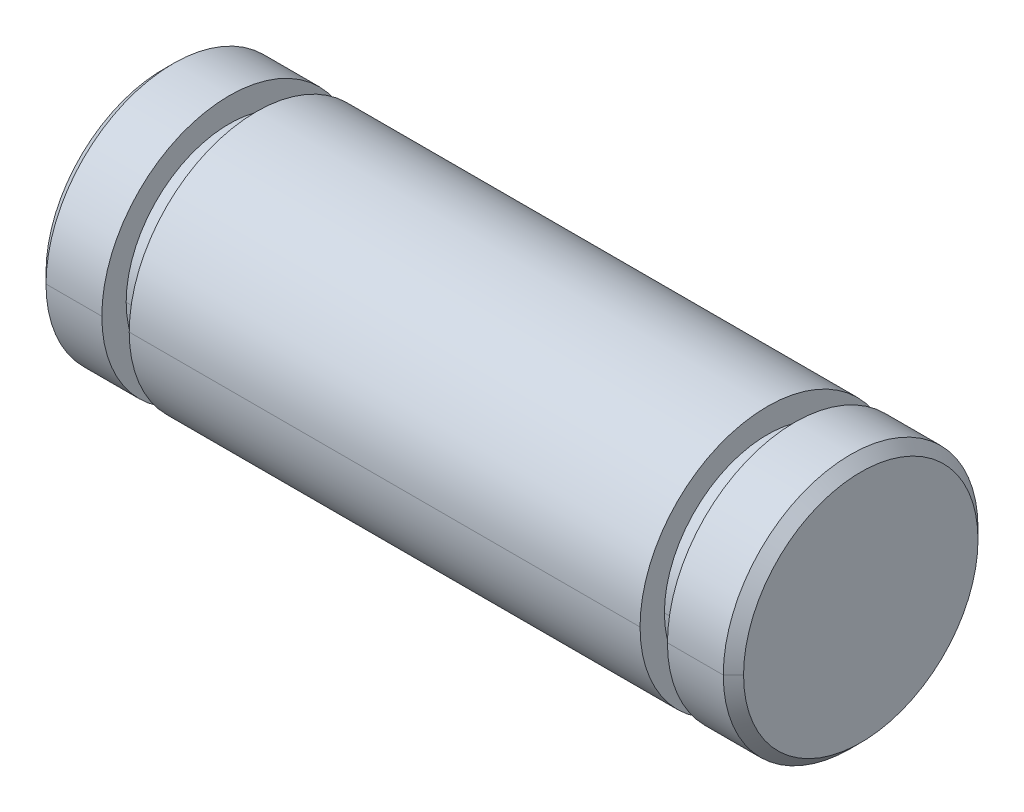
ISO-10303-21;
HEADER;
FILE_DESCRIPTION(('STEP AP214'),'2;1');
FILE_NAME('part.step','',(''),(''),'','','');
FILE_SCHEMA(('AUTOMOTIVE_DESIGN { 1 0 10303 214 1 1 1 1 }'));
ENDSEC;
DATA;
#1=APPLICATION_CONTEXT('core data for automotive mechanical design processes');
#2=APPLICATION_PROTOCOL_DEFINITION('international standard','automotive_design',2000,#1);
#3=PRODUCT_CONTEXT('',#1,'mechanical');
#4=PRODUCT('Part','Part','',(#3));
#5=PRODUCT_RELATED_PRODUCT_CATEGORY('part','',(#4));
#6=PRODUCT_DEFINITION_FORMATION('','',#4);
#7=PRODUCT_DEFINITION_CONTEXT('part definition',#1,'design');
#8=PRODUCT_DEFINITION('design','',#6,#7);
#9=PRODUCT_DEFINITION_SHAPE('','',#8);
#10=(LENGTH_UNIT() NAMED_UNIT(*) SI_UNIT(.MILLI.,.METRE.));
#11=(NAMED_UNIT(*) PLANE_ANGLE_UNIT() SI_UNIT($,.RADIAN.));
#12=(NAMED_UNIT(*) SI_UNIT($,.STERADIAN.) SOLID_ANGLE_UNIT());
#13=UNCERTAINTY_MEASURE_WITH_UNIT(LENGTH_MEASURE(1.E-05),#10,'distance_accuracy_value','');
#14=(GEOMETRIC_REPRESENTATION_CONTEXT(3) GLOBAL_UNCERTAINTY_ASSIGNED_CONTEXT((#13)) GLOBAL_UNIT_ASSIGNED_CONTEXT((#10,
#11,#12)) REPRESENTATION_CONTEXT('',''));
#15=CARTESIAN_POINT('',(0.,0.,0.));
#16=DIRECTION('',(0.,0.,1.));
#17=DIRECTION('',(1.,0.,0.));
#18=AXIS2_PLACEMENT_3D('',#15,#16,#17);
#19=CARTESIAN_POINT('',(12.7127,0.,0.));
#20=DIRECTION('',(-1.,0.,0.));
#21=DIRECTION('',(0.,-1.,0.));
#22=AXIS2_PLACEMENT_3D('',#19,#20,#21);
#23=CONICAL_SURFACE('',#22,4.78155,0.7853981634);
#24=CARTESIAN_POINT('',(13.0937,0.,0.));
#25=DIRECTION('',(1.,0.,0.));
#26=DIRECTION('',(0.,0.,-1.));
#27=AXIS2_PLACEMENT_3D('',#24,#25,#26);
#28=CIRCLE('',#27,4.40055);
#29=CARTESIAN_POINT('',(13.0937,0.,-4.40055));
#30=VERTEX_POINT('',#29);
#31=CARTESIAN_POINT('',(13.093699999999,0.,4.40054999999903));
#32=VERTEX_POINT('',#31);
#33=EDGE_CURVE('E10',#30,#32,#28,.T.);
#34=ORIENTED_EDGE('',*,*,#33,.F.);
#35=DIRECTION('',(-0.707106781184743,0.,-0.707106781188353));
#36=VECTOR('',#35,1.);
#37=CARTESIAN_POINT('',(13.093699999999,0.,-4.40054999999903));
#38=LINE('',#37,#36);
#39=CARTESIAN_POINT('',(12.7127,0.,-4.78155));
#40=VERTEX_POINT('',#39);
#41=EDGE_CURVE('E24',#30,#40,#38,.T.);
#42=ORIENTED_EDGE('',*,*,#41,.T.);
#43=CARTESIAN_POINT('',(12.7127,0.,0.));
#44=DIRECTION('',(1.,0.,0.));
#45=DIRECTION('',(0.,0.,-1.));
#46=AXIS2_PLACEMENT_3D('',#43,#44,#45);
#47=CIRCLE('',#46,4.78155);
#48=CARTESIAN_POINT('',(12.7127,0.,4.78155));
#49=VERTEX_POINT('',#48);
#50=EDGE_CURVE('E262',#40,#49,#47,.T.);
#51=ORIENTED_EDGE('',*,*,#50,.T.);
#52=DIRECTION('',(-0.707106781184743,0.,0.707106781188353));
#53=VECTOR('',#52,1.);
#54=CARTESIAN_POINT('',(13.093699999999,0.,4.40054999999903));
#55=LINE('',#54,#53);
#56=EDGE_CURVE('E257',#32,#49,#55,.T.);
#57=ORIENTED_EDGE('',*,*,#56,.F.);
#58=EDGE_LOOP('',(#34,#42,#51,#57));
#59=FACE_BOUND('',#58,.T.);
#60=ADVANCED_FACE('F16',(#59),#23,.T.);
#61=CARTESIAN_POINT('',(12.7127,0.,0.));
#62=DIRECTION('',(-1.,0.,0.));
#63=DIRECTION('',(0.,1.,0.));
#64=AXIS2_PLACEMENT_3D('',#61,#62,#63);
#65=CONICAL_SURFACE('',#64,4.78155,0.7853981634);
#66=CARTESIAN_POINT('',(12.7127,0.,0.));
#67=DIRECTION('',(1.,0.,0.));
#68=DIRECTION('',(0.,0.,-1.));
#69=AXIS2_PLACEMENT_3D('',#66,#67,#68);
#70=CIRCLE('',#69,4.78155);
#71=EDGE_CURVE('E253',#49,#40,#70,.T.);
#72=ORIENTED_EDGE('',*,*,#71,.T.);
#73=ORIENTED_EDGE('',*,*,#41,.F.);
#74=CARTESIAN_POINT('',(13.0937,0.,0.));
#75=DIRECTION('',(1.,0.,0.));
#76=DIRECTION('',(0.,0.,-1.));
#77=AXIS2_PLACEMENT_3D('',#74,#75,#76);
#78=CIRCLE('',#77,4.40055);
#79=EDGE_CURVE('E248',#32,#30,#78,.T.);
#80=ORIENTED_EDGE('',*,*,#79,.F.);
#81=ORIENTED_EDGE('',*,*,#56,.T.);
#82=EDGE_LOOP('',(#72,#73,#80,#81));
#83=FACE_BOUND('',#82,.T.);
#84=ADVANCED_FACE('F276',(#83),#65,.T.);
#85=CARTESIAN_POINT('',(13.0937,4.40055,0.));
#86=DIRECTION('',(-1.,0.,0.));
#87=DIRECTION('',(0.,0.,1.));
#88=AXIS2_PLACEMENT_3D('',#85,#86,#87);
#89=PLANE('',#88);
#90=ORIENTED_EDGE('',*,*,#33,.T.);
#91=ORIENTED_EDGE('',*,*,#79,.T.);
#92=EDGE_LOOP('',(#90,#91));
#93=FACE_BOUND('',#92,.T.);
#94=ADVANCED_FACE('F354',(#93),#89,.F.);
#95=CARTESIAN_POINT('',(13.0937,0.,0.));
#96=DIRECTION('',(-1.,0.,0.));
#97=DIRECTION('',(0.,1.,0.));
#98=AXIS2_PLACEMENT_3D('',#95,#96,#97);
#99=CYLINDRICAL_SURFACE('',#98,4.78155);
#100=CARTESIAN_POINT('',(10.6172,0.,0.));
#101=DIRECTION('',(1.,0.,0.));
#102=DIRECTION('',(0.,0.,-1.));
#103=AXIS2_PLACEMENT_3D('',#100,#101,#102);
#104=CIRCLE('',#103,4.78155);
#105=CARTESIAN_POINT('',(10.6172,0.,4.78155));
#106=VERTEX_POINT('',#105);
#107=CARTESIAN_POINT('',(10.6172,0.,-4.78155));
#108=VERTEX_POINT('',#107);
#109=EDGE_CURVE('E244',#106,#108,#104,.T.);
#110=ORIENTED_EDGE('',*,*,#109,.T.);
#111=DIRECTION('',(-1.,0.,0.));
#112=VECTOR('',#111,1.);
#113=CARTESIAN_POINT('',(12.7127,0.,-4.78155));
#114=LINE('',#113,#112);
#115=EDGE_CURVE('E239',#40,#108,#114,.T.);
#116=ORIENTED_EDGE('',*,*,#115,.F.);
#117=ORIENTED_EDGE('',*,*,#71,.F.);
#118=DIRECTION('',(-1.,0.,0.));
#119=VECTOR('',#118,1.);
#120=CARTESIAN_POINT('',(12.7127,0.,4.78155));
#121=LINE('',#120,#119);
#122=EDGE_CURVE('E235',#49,#106,#121,.T.);
#123=ORIENTED_EDGE('',*,*,#122,.T.);
#124=EDGE_LOOP('',(#110,#116,#117,#123));
#125=FACE_BOUND('',#124,.T.);
#126=ADVANCED_FACE('F279',(#125),#99,.T.);
#127=CARTESIAN_POINT('',(13.0937,0.,0.));
#128=DIRECTION('',(-1.,0.,0.));
#129=DIRECTION('',(0.,-1.,0.));
#130=AXIS2_PLACEMENT_3D('',#127,#128,#129);
#131=CYLINDRICAL_SURFACE('',#130,4.78155);
#132=ORIENTED_EDGE('',*,*,#50,.F.);
#133=ORIENTED_EDGE('',*,*,#115,.T.);
#134=CARTESIAN_POINT('',(10.6172,0.,0.));
#135=DIRECTION('',(1.,0.,0.));
#136=DIRECTION('',(0.,0.,-1.));
#137=AXIS2_PLACEMENT_3D('',#134,#135,#136);
#138=CIRCLE('',#137,4.78155);
#139=EDGE_CURVE('E230',#108,#106,#138,.T.);
#140=ORIENTED_EDGE('',*,*,#139,.T.);
#141=ORIENTED_EDGE('',*,*,#122,.F.);
#142=EDGE_LOOP('',(#132,#133,#140,#141));
#143=FACE_BOUND('',#142,.T.);
#144=ADVANCED_FACE('F280',(#143),#131,.T.);
#145=CARTESIAN_POINT('',(10.6172,3.86715,0.));
#146=DIRECTION('',(1.,0.,0.));
#147=DIRECTION('',(0.,0.,-1.));
#148=AXIS2_PLACEMENT_3D('',#145,#146,#147);
#149=PLANE('',#148);
#150=ORIENTED_EDGE('',*,*,#139,.F.);
#151=ORIENTED_EDGE('',*,*,#109,.F.);
#152=EDGE_LOOP('',(#150,#151));
#153=FACE_BOUND('',#152,.T.);
#154=CARTESIAN_POINT('',(10.6172,0.,0.));
#155=DIRECTION('',(1.,0.,0.));
#156=DIRECTION('',(0.,0.,-1.));
#157=AXIS2_PLACEMENT_3D('',#154,#155,#156);
#158=CIRCLE('',#157,3.86715);
#159=CARTESIAN_POINT('',(10.6172,0.,-3.86715));
#160=VERTEX_POINT('',#159);
#161=CARTESIAN_POINT('',(10.6172,0.,3.86715));
#162=VERTEX_POINT('',#161);
#163=EDGE_CURVE('E226',#160,#162,#158,.T.);
#164=ORIENTED_EDGE('',*,*,#163,.T.);
#165=CARTESIAN_POINT('',(10.6172,0.,0.));
#166=DIRECTION('',(1.,0.,0.));
#167=DIRECTION('',(0.,0.,-1.));
#168=AXIS2_PLACEMENT_3D('',#165,#166,#167);
#169=CIRCLE('',#168,3.86715);
#170=EDGE_CURVE('E222',#162,#160,#169,.T.);
#171=ORIENTED_EDGE('',*,*,#170,.T.);
#172=EDGE_LOOP('',(#164,#171));
#173=FACE_BOUND('',#172,.T.);
#174=ADVANCED_FACE('F284',(#153,#173),#149,.F.);
#175=CARTESIAN_POINT('',(13.0937,0.,0.));
#176=DIRECTION('',(-1.,0.,0.));
#177=DIRECTION('',(0.,1.,0.));
#178=AXIS2_PLACEMENT_3D('',#175,#176,#177);
#179=CYLINDRICAL_SURFACE('',#178,3.86715);
#180=CARTESIAN_POINT('',(9.5885,0.,0.));
#181=DIRECTION('',(1.,0.,0.));
#182=DIRECTION('',(0.,0.,-1.));
#183=AXIS2_PLACEMENT_3D('',#180,#181,#182);
#184=CIRCLE('',#183,3.86715);
#185=CARTESIAN_POINT('',(9.5885,0.,3.86715));
#186=VERTEX_POINT('',#185);
#187=CARTESIAN_POINT('',(9.5885,0.,-3.86715));
#188=VERTEX_POINT('',#187);
#189=EDGE_CURVE('E218',#186,#188,#184,.T.);
#190=ORIENTED_EDGE('',*,*,#189,.T.);
#191=DIRECTION('',(-1.,0.,0.));
#192=VECTOR('',#191,1.);
#193=CARTESIAN_POINT('',(10.6172,0.,-3.86715));
#194=LINE('',#193,#192);
#195=EDGE_CURVE('E213',#160,#188,#194,.T.);
#196=ORIENTED_EDGE('',*,*,#195,.F.);
#197=ORIENTED_EDGE('',*,*,#170,.F.);
#198=DIRECTION('',(-1.,0.,0.));
#199=VECTOR('',#198,1.);
#200=CARTESIAN_POINT('',(10.6172,0.,3.86715));
#201=LINE('',#200,#199);
#202=EDGE_CURVE('E209',#162,#186,#201,.T.);
#203=ORIENTED_EDGE('',*,*,#202,.T.);
#204=EDGE_LOOP('',(#190,#196,#197,#203));
#205=FACE_BOUND('',#204,.T.);
#206=ADVANCED_FACE('F287',(#205),#179,.T.);
#207=CARTESIAN_POINT('',(13.0937,0.,0.));
#208=DIRECTION('',(-1.,0.,0.));
#209=DIRECTION('',(0.,-1.,0.));
#210=AXIS2_PLACEMENT_3D('',#207,#208,#209);
#211=CYLINDRICAL_SURFACE('',#210,3.86715);
#212=ORIENTED_EDGE('',*,*,#163,.F.);
#213=ORIENTED_EDGE('',*,*,#195,.T.);
#214=CARTESIAN_POINT('',(9.5885,0.,0.));
#215=DIRECTION('',(1.,0.,0.));
#216=DIRECTION('',(0.,0.,-1.));
#217=AXIS2_PLACEMENT_3D('',#214,#215,#216);
#218=CIRCLE('',#217,3.86715);
#219=EDGE_CURVE('E204',#188,#186,#218,.T.);
#220=ORIENTED_EDGE('',*,*,#219,.T.);
#221=ORIENTED_EDGE('',*,*,#202,.F.);
#222=EDGE_LOOP('',(#212,#213,#220,#221));
#223=FACE_BOUND('',#222,.T.);
#224=ADVANCED_FACE('F295',(#223),#211,.T.);
#225=CARTESIAN_POINT('',(9.5885,4.78155,0.));
#226=DIRECTION('',(-1.,0.,0.));
#227=DIRECTION('',(0.,0.,1.));
#228=AXIS2_PLACEMENT_3D('',#225,#226,#227);
#229=PLANE('',#228);
#230=ORIENTED_EDGE('',*,*,#219,.F.);
#231=ORIENTED_EDGE('',*,*,#189,.F.);
#232=EDGE_LOOP('',(#230,#231));
#233=FACE_BOUND('',#232,.T.);
#234=CARTESIAN_POINT('',(9.5885,0.,0.));
#235=DIRECTION('',(1.,0.,0.));
#236=DIRECTION('',(0.,0.,-1.));
#237=AXIS2_PLACEMENT_3D('',#234,#235,#236);
#238=CIRCLE('',#237,4.78155);
#239=CARTESIAN_POINT('',(9.5885,0.,-4.78155));
#240=VERTEX_POINT('',#239);
#241=CARTESIAN_POINT('',(9.5885,0.,4.78155));
#242=VERTEX_POINT('',#241);
#243=EDGE_CURVE('E200',#240,#242,#238,.T.);
#244=ORIENTED_EDGE('',*,*,#243,.T.);
#245=CARTESIAN_POINT('',(9.5885,0.,0.));
#246=DIRECTION('',(1.,0.,0.));
#247=DIRECTION('',(0.,0.,-1.));
#248=AXIS2_PLACEMENT_3D('',#245,#246,#247);
#249=CIRCLE('',#248,4.78155);
#250=EDGE_CURVE('E196',#242,#240,#249,.T.);
#251=ORIENTED_EDGE('',*,*,#250,.T.);
#252=EDGE_LOOP('',(#244,#251));
#253=FACE_BOUND('',#252,.T.);
#254=ADVANCED_FACE('F299',(#233,#253),#229,.F.);
#255=CARTESIAN_POINT('',(13.0937,0.,0.));
#256=DIRECTION('',(-1.,0.,0.));
#257=DIRECTION('',(0.,1.,0.));
#258=AXIS2_PLACEMENT_3D('',#255,#256,#257);
#259=CYLINDRICAL_SURFACE('',#258,4.78155);
#260=CARTESIAN_POINT('',(-9.5885,0.,0.));
#261=DIRECTION('',(1.,0.,0.));
#262=DIRECTION('',(0.,0.,-1.));
#263=AXIS2_PLACEMENT_3D('',#260,#261,#262);
#264=CIRCLE('',#263,4.78155);
#265=CARTESIAN_POINT('',(-9.5885,0.,4.78155));
#266=VERTEX_POINT('',#265);
#267=CARTESIAN_POINT('',(-9.5885,0.,-4.78155));
#268=VERTEX_POINT('',#267);
#269=EDGE_CURVE('E192',#266,#268,#264,.T.);
#270=ORIENTED_EDGE('',*,*,#269,.T.);
#271=DIRECTION('',(-1.,0.,0.));
#272=VECTOR('',#271,1.);
#273=CARTESIAN_POINT('',(9.5885,0.,-4.78155));
#274=LINE('',#273,#272);
#275=EDGE_CURVE('E187',#240,#268,#274,.T.);
#276=ORIENTED_EDGE('',*,*,#275,.F.);
#277=ORIENTED_EDGE('',*,*,#250,.F.);
#278=DIRECTION('',(-1.,0.,0.));
#279=VECTOR('',#278,1.);
#280=CARTESIAN_POINT('',(9.5885,0.,4.78155));
#281=LINE('',#280,#279);
#282=EDGE_CURVE('E183',#242,#266,#281,.T.);
#283=ORIENTED_EDGE('',*,*,#282,.T.);
#284=EDGE_LOOP('',(#270,#276,#277,#283));
#285=FACE_BOUND('',#284,.T.);
#286=ADVANCED_FACE('F302',(#285),#259,.T.);
#287=CARTESIAN_POINT('',(13.0937,0.,0.));
#288=DIRECTION('',(-1.,0.,0.));
#289=DIRECTION('',(0.,-1.,0.));
#290=AXIS2_PLACEMENT_3D('',#287,#288,#289);
#291=CYLINDRICAL_SURFACE('',#290,4.78155);
#292=ORIENTED_EDGE('',*,*,#243,.F.);
#293=ORIENTED_EDGE('',*,*,#275,.T.);
#294=CARTESIAN_POINT('',(-9.5885,0.,0.));
#295=DIRECTION('',(1.,0.,0.));
#296=DIRECTION('',(0.,0.,-1.));
#297=AXIS2_PLACEMENT_3D('',#294,#295,#296);
#298=CIRCLE('',#297,4.78155);
#299=EDGE_CURVE('E178',#268,#266,#298,.T.);
#300=ORIENTED_EDGE('',*,*,#299,.T.);
#301=ORIENTED_EDGE('',*,*,#282,.F.);
#302=EDGE_LOOP('',(#292,#293,#300,#301));
#303=FACE_BOUND('',#302,.T.);
#304=ADVANCED_FACE('F310',(#303),#291,.T.);
#305=CARTESIAN_POINT('',(-9.5885,3.86715,0.));
#306=DIRECTION('',(1.,0.,0.));
#307=DIRECTION('',(0.,0.,-1.));
#308=AXIS2_PLACEMENT_3D('',#305,#306,#307);
#309=PLANE('',#308);
#310=ORIENTED_EDGE('',*,*,#299,.F.);
#311=ORIENTED_EDGE('',*,*,#269,.F.);
#312=EDGE_LOOP('',(#310,#311));
#313=FACE_BOUND('',#312,.T.);
#314=CARTESIAN_POINT('',(-9.5885,0.,0.));
#315=DIRECTION('',(1.,0.,0.));
#316=DIRECTION('',(0.,0.,-1.));
#317=AXIS2_PLACEMENT_3D('',#314,#315,#316);
#318=CIRCLE('',#317,3.86715);
#319=CARTESIAN_POINT('',(-9.5885,0.,-3.86715));
#320=VERTEX_POINT('',#319);
#321=CARTESIAN_POINT('',(-9.5885,0.,3.86715));
#322=VERTEX_POINT('',#321);
#323=EDGE_CURVE('E174',#320,#322,#318,.T.);
#324=ORIENTED_EDGE('',*,*,#323,.T.);
#325=CARTESIAN_POINT('',(-9.5885,0.,0.));
#326=DIRECTION('',(1.,0.,0.));
#327=DIRECTION('',(0.,0.,-1.));
#328=AXIS2_PLACEMENT_3D('',#325,#326,#327);
#329=CIRCLE('',#328,3.86715);
#330=EDGE_CURVE('E170',#322,#320,#329,.T.);
#331=ORIENTED_EDGE('',*,*,#330,.T.);
#332=EDGE_LOOP('',(#324,#331));
#333=FACE_BOUND('',#332,.T.);
#334=ADVANCED_FACE('F314',(#313,#333),#309,.F.);
#335=CARTESIAN_POINT('',(13.0937,0.,0.));
#336=DIRECTION('',(-1.,0.,0.));
#337=DIRECTION('',(0.,1.,0.));
#338=AXIS2_PLACEMENT_3D('',#335,#336,#337);
#339=CYLINDRICAL_SURFACE('',#338,3.86715);
#340=CARTESIAN_POINT('',(-10.6172,0.,0.));
#341=DIRECTION('',(1.,0.,0.));
#342=DIRECTION('',(0.,0.,-1.));
#343=AXIS2_PLACEMENT_3D('',#340,#341,#342);
#344=CIRCLE('',#343,3.86715);
#345=CARTESIAN_POINT('',(-10.6172,0.,3.86715));
#346=VERTEX_POINT('',#345);
#347=CARTESIAN_POINT('',(-10.6172,0.,-3.86715));
#348=VERTEX_POINT('',#347);
#349=EDGE_CURVE('E166',#346,#348,#344,.T.);
#350=ORIENTED_EDGE('',*,*,#349,.T.);
#351=DIRECTION('',(-1.,0.,0.));
#352=VECTOR('',#351,1.);
#353=CARTESIAN_POINT('',(-9.5885,0.,-3.86715));
#354=LINE('',#353,#352);
#355=EDGE_CURVE('E161',#320,#348,#354,.T.);
#356=ORIENTED_EDGE('',*,*,#355,.F.);
#357=ORIENTED_EDGE('',*,*,#330,.F.);
#358=DIRECTION('',(-1.,0.,0.));
#359=VECTOR('',#358,1.);
#360=CARTESIAN_POINT('',(-9.5885,0.,3.86715));
#361=LINE('',#360,#359);
#362=EDGE_CURVE('E157',#322,#346,#361,.T.);
#363=ORIENTED_EDGE('',*,*,#362,.T.);
#364=EDGE_LOOP('',(#350,#356,#357,#363));
#365=FACE_BOUND('',#364,.T.);
#366=ADVANCED_FACE('F317',(#365),#339,.T.);
#367=CARTESIAN_POINT('',(13.0937,0.,0.));
#368=DIRECTION('',(-1.,0.,0.));
#369=DIRECTION('',(0.,-1.,0.));
#370=AXIS2_PLACEMENT_3D('',#367,#368,#369);
#371=CYLINDRICAL_SURFACE('',#370,3.86715);
#372=ORIENTED_EDGE('',*,*,#323,.F.);
#373=ORIENTED_EDGE('',*,*,#355,.T.);
#374=CARTESIAN_POINT('',(-10.6172,0.,0.));
#375=DIRECTION('',(1.,0.,0.));
#376=DIRECTION('',(0.,0.,-1.));
#377=AXIS2_PLACEMENT_3D('',#374,#375,#376);
#378=CIRCLE('',#377,3.86715);
#379=EDGE_CURVE('E152',#348,#346,#378,.T.);
#380=ORIENTED_EDGE('',*,*,#379,.T.);
#381=ORIENTED_EDGE('',*,*,#362,.F.);
#382=EDGE_LOOP('',(#372,#373,#380,#381));
#383=FACE_BOUND('',#382,.T.);
#384=ADVANCED_FACE('F325',(#383),#371,.T.);
#385=CARTESIAN_POINT('',(-10.6172,4.78155,0.));
#386=DIRECTION('',(-1.,0.,0.));
#387=DIRECTION('',(0.,0.,1.));
#388=AXIS2_PLACEMENT_3D('',#385,#386,#387);
#389=PLANE('',#388);
#390=ORIENTED_EDGE('',*,*,#379,.F.);
#391=ORIENTED_EDGE('',*,*,#349,.F.);
#392=EDGE_LOOP('',(#390,#391));
#393=FACE_BOUND('',#392,.T.);
#394=CARTESIAN_POINT('',(-10.6172,0.,0.));
#395=DIRECTION('',(1.,0.,0.));
#396=DIRECTION('',(0.,0.,-1.));
#397=AXIS2_PLACEMENT_3D('',#394,#395,#396);
#398=CIRCLE('',#397,4.78155);
#399=CARTESIAN_POINT('',(-10.6172,0.,-4.78155));
#400=VERTEX_POINT('',#399);
#401=CARTESIAN_POINT('',(-10.6172,0.,4.78155));
#402=VERTEX_POINT('',#401);
#403=EDGE_CURVE('E148',#400,#402,#398,.T.);
#404=ORIENTED_EDGE('',*,*,#403,.T.);
#405=CARTESIAN_POINT('',(-10.6172,0.,0.));
#406=DIRECTION('',(1.,0.,0.));
#407=DIRECTION('',(0.,0.,-1.));
#408=AXIS2_PLACEMENT_3D('',#405,#406,#407);
#409=CIRCLE('',#408,4.78155);
#410=EDGE_CURVE('E144',#402,#400,#409,.T.);
#411=ORIENTED_EDGE('',*,*,#410,.T.);
#412=EDGE_LOOP('',(#404,#411));
#413=FACE_BOUND('',#412,.T.);
#414=ADVANCED_FACE('F329',(#393,#413),#389,.F.);
#415=CARTESIAN_POINT('',(13.0937,0.,0.));
#416=DIRECTION('',(-1.,0.,0.));
#417=DIRECTION('',(0.,1.,0.));
#418=AXIS2_PLACEMENT_3D('',#415,#416,#417);
#419=CYLINDRICAL_SURFACE('',#418,4.78155);
#420=CARTESIAN_POINT('',(-12.7127,0.,0.));
#421=DIRECTION('',(1.,0.,0.));
#422=DIRECTION('',(0.,0.,-1.));
#423=AXIS2_PLACEMENT_3D('',#420,#421,#422);
#424=CIRCLE('',#423,4.78155);
#425=CARTESIAN_POINT('',(-12.7127,0.,4.78155));
#426=VERTEX_POINT('',#425);
#427=CARTESIAN_POINT('',(-12.7127,0.,-4.78155));
#428=VERTEX_POINT('',#427);
#429=EDGE_CURVE('E115',#426,#428,#424,.T.);
#430=ORIENTED_EDGE('',*,*,#429,.T.);
#431=DIRECTION('',(-1.,0.,0.));
#432=VECTOR('',#431,1.);
#433=CARTESIAN_POINT('',(-10.6172,0.,-4.78155));
#434=LINE('',#433,#432);
#435=EDGE_CURVE('E136',#400,#428,#434,.T.);
#436=ORIENTED_EDGE('',*,*,#435,.F.);
#437=ORIENTED_EDGE('',*,*,#410,.F.);
#438=DIRECTION('',(-1.,0.,0.));
#439=VECTOR('',#438,1.);
#440=CARTESIAN_POINT('',(-10.6172,0.,4.78155));
#441=LINE('',#440,#439);
#442=EDGE_CURVE('E132',#402,#426,#441,.T.);
#443=ORIENTED_EDGE('',*,*,#442,.T.);
#444=EDGE_LOOP('',(#430,#436,#437,#443));
#445=FACE_BOUND('',#444,.T.);
#446=ADVANCED_FACE('F332',(#445),#419,.T.);
#447=CARTESIAN_POINT('',(13.0937,0.,0.));
#448=DIRECTION('',(-1.,0.,0.));
#449=DIRECTION('',(0.,-1.,0.));
#450=AXIS2_PLACEMENT_3D('',#447,#448,#449);
#451=CYLINDRICAL_SURFACE('',#450,4.78155);
#452=ORIENTED_EDGE('',*,*,#403,.F.);
#453=ORIENTED_EDGE('',*,*,#435,.T.);
#454=CARTESIAN_POINT('',(-12.7127,0.,0.));
#455=DIRECTION('',(1.,0.,0.));
#456=DIRECTION('',(0.,0.,-1.));
#457=AXIS2_PLACEMENT_3D('',#454,#455,#456);
#458=CIRCLE('',#457,4.78155);
#459=EDGE_CURVE('E127',#428,#426,#458,.T.);
#460=ORIENTED_EDGE('',*,*,#459,.T.);
#461=ORIENTED_EDGE('',*,*,#442,.F.);
#462=EDGE_LOOP('',(#452,#453,#460,#461));
#463=FACE_BOUND('',#462,.T.);
#464=ADVANCED_FACE('F340',(#463),#451,.T.);
#465=CARTESIAN_POINT('',(-13.0937,0.,0.));
#466=DIRECTION('',(1.,0.,0.));
#467=DIRECTION('',(0.,-1.,0.));
#468=AXIS2_PLACEMENT_3D('',#465,#466,#467);
#469=CONICAL_SURFACE('',#468,4.40055,0.7853981634);
#470=ORIENTED_EDGE('',*,*,#459,.F.);
#471=DIRECTION('',(0.707106781184743,0.,-0.707106781188353));
#472=VECTOR('',#471,1.);
#473=CARTESIAN_POINT('',(-13.0937,0.,-4.40055));
#474=LINE('',#473,#472);
#475=CARTESIAN_POINT('',(-13.0937,0.,-4.40055));
#476=VERTEX_POINT('',#475);
#477=EDGE_CURVE('E107',#476,#428,#474,.T.);
#478=ORIENTED_EDGE('',*,*,#477,.F.);
#479=CARTESIAN_POINT('',(-13.0937,0.,0.));
#480=DIRECTION('',(1.,0.,0.));
#481=DIRECTION('',(0.,0.,-1.));
#482=AXIS2_PLACEMENT_3D('',#479,#480,#481);
#483=CIRCLE('',#482,4.40055);
#484=CARTESIAN_POINT('',(-13.0937,0.,4.40055));
#485=VERTEX_POINT('',#484);
#486=EDGE_CURVE('E100',#476,#485,#483,.T.);
#487=ORIENTED_EDGE('',*,*,#486,.T.);
#488=DIRECTION('',(0.707106781184746,0.,0.707106781188349));
#489=VECTOR('',#488,1.);
#490=CARTESIAN_POINT('',(-13.0937,0.,4.40055));
#491=LINE('',#490,#489);
#492=EDGE_CURVE('E104',#485,#426,#491,.T.);
#493=ORIENTED_EDGE('',*,*,#492,.T.);
#494=EDGE_LOOP('',(#470,#478,#487,#493));
#495=FACE_BOUND('',#494,.T.);
#496=ADVANCED_FACE('F103',(#495),#469,.T.);
#497=CARTESIAN_POINT('',(-13.0937,0.,0.));
#498=DIRECTION('',(1.,0.,0.));
#499=DIRECTION('',(0.,1.,0.));
#500=AXIS2_PLACEMENT_3D('',#497,#498,#499);
#501=CONICAL_SURFACE('',#500,4.40055,0.7853981634);
#502=CARTESIAN_POINT('',(-13.0937,0.,0.));
#503=DIRECTION('',(1.,0.,0.));
#504=DIRECTION('',(0.,0.,-1.));
#505=AXIS2_PLACEMENT_3D('',#502,#503,#504);
#506=CIRCLE('',#505,4.40055);
#507=EDGE_CURVE('E114',#485,#476,#506,.T.);
#508=ORIENTED_EDGE('',*,*,#507,.T.);
#509=ORIENTED_EDGE('',*,*,#477,.T.);
#510=ORIENTED_EDGE('',*,*,#429,.F.);
#511=ORIENTED_EDGE('',*,*,#492,.F.);
#512=EDGE_LOOP('',(#508,#509,#510,#511));
#513=FACE_BOUND('',#512,.T.);
#514=ADVANCED_FACE('F113',(#513),#501,.T.);
#515=CARTESIAN_POINT('',(-13.0937,0.,0.));
#516=DIRECTION('',(1.,0.,0.));
#517=DIRECTION('',(0.,0.,-1.));
#518=AXIS2_PLACEMENT_3D('',#515,#516,#517);
#519=PLANE('',#518);
#520=ORIENTED_EDGE('',*,*,#486,.F.);
#521=ORIENTED_EDGE('',*,*,#507,.F.);
#522=EDGE_LOOP('',(#520,#521));
#523=FACE_BOUND('',#522,.T.);
#524=ADVANCED_FACE('F117',(#523),#519,.F.);
#525=CLOSED_SHELL('',(#60,#84,#94,#126,#144,#174,#206,#224,#254,#286,#304,#334,#366,#384,#414,
#446,#464,#496,#514,#524));
#526=MANIFOLD_SOLID_BREP('B1',#525);
#527=ADVANCED_BREP_SHAPE_REPRESENTATION('',(#18,#526),#14);
#528=SHAPE_DEFINITION_REPRESENTATION(#9,#527);
ENDSEC;
END-ISO-10303-21;
